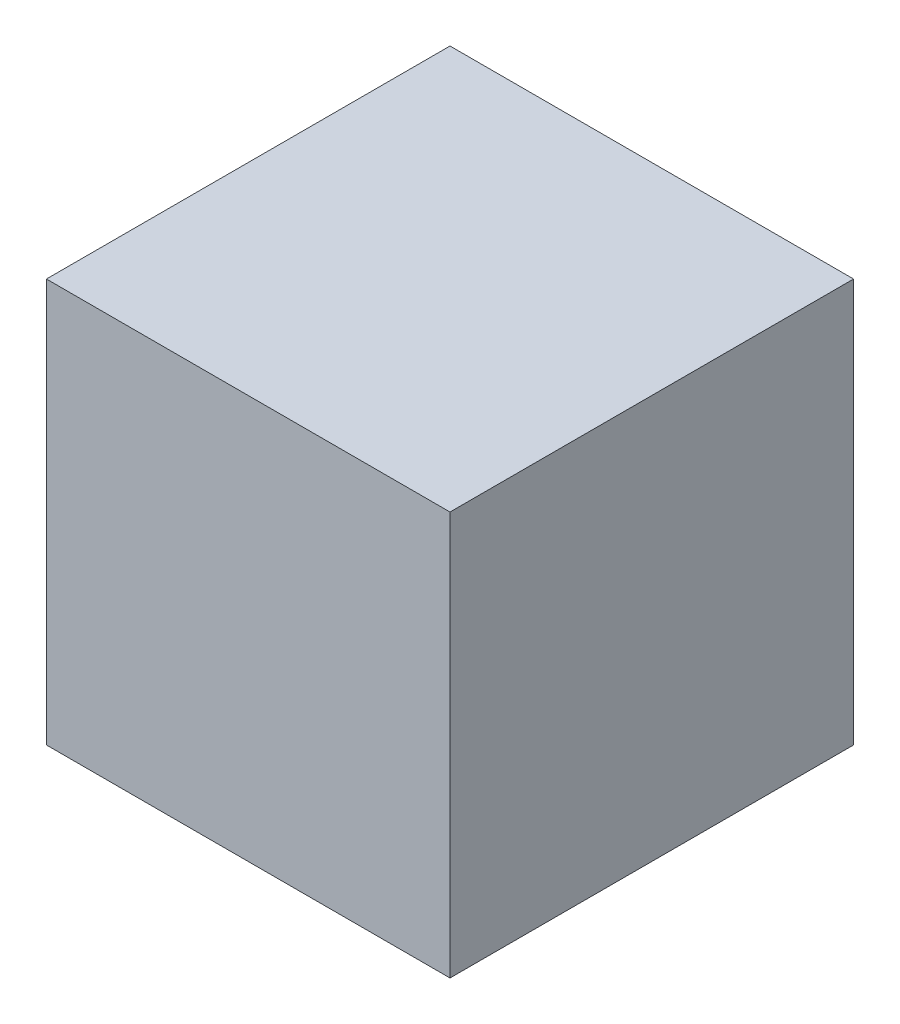
ISO-10303-21;
HEADER;
FILE_DESCRIPTION(('STEP AP214'),'2;1');
FILE_NAME('part.step','',(''),(''),'','','');
FILE_SCHEMA(('AUTOMOTIVE_DESIGN { 1 0 10303 214 1 1 1 1 }'));
ENDSEC;
DATA;
#1=APPLICATION_CONTEXT('core data for automotive mechanical design processes');
#2=APPLICATION_PROTOCOL_DEFINITION('international standard','automotive_design',2000,#1);
#3=PRODUCT_CONTEXT('',#1,'mechanical');
#4=PRODUCT('Part','Part','',(#3));
#5=PRODUCT_RELATED_PRODUCT_CATEGORY('part','',(#4));
#6=PRODUCT_DEFINITION_FORMATION('','',#4);
#7=PRODUCT_DEFINITION_CONTEXT('part definition',#1,'design');
#8=PRODUCT_DEFINITION('design','',#6,#7);
#9=PRODUCT_DEFINITION_SHAPE('','',#8);
#10=(LENGTH_UNIT() NAMED_UNIT(*) SI_UNIT(.MILLI.,.METRE.));
#11=(NAMED_UNIT(*) PLANE_ANGLE_UNIT() SI_UNIT($,.RADIAN.));
#12=(NAMED_UNIT(*) SI_UNIT($,.STERADIAN.) SOLID_ANGLE_UNIT());
#13=UNCERTAINTY_MEASURE_WITH_UNIT(LENGTH_MEASURE(1.E-05),#10,'distance_accuracy_value','');
#14=(GEOMETRIC_REPRESENTATION_CONTEXT(3) GLOBAL_UNCERTAINTY_ASSIGNED_CONTEXT((#13)) GLOBAL_UNIT_ASSIGNED_CONTEXT((#10,
#11,#12)) REPRESENTATION_CONTEXT('',''));
#15=CARTESIAN_POINT('',(0.,0.,0.));
#16=DIRECTION('',(0.,0.,1.));
#17=DIRECTION('',(1.,0.,0.));
#18=AXIS2_PLACEMENT_3D('',#15,#16,#17);
#19=CARTESIAN_POINT('',(0.,0.,58.));
#20=DIRECTION('',(1.,0.,0.));
#21=DIRECTION('',(0.,0.,-1.));
#22=AXIS2_PLACEMENT_3D('',#19,#20,#21);
#23=PLANE('',#22);
#24=DIRECTION('',(0.,-1.,0.));
#25=VECTOR('',#24,1.);
#26=CARTESIAN_POINT('',(0.,0.,0.));
#27=LINE('',#26,#25);
#28=CARTESIAN_POINT('',(0.,58.,0.));
#29=VERTEX_POINT('',#28);
#30=CARTESIAN_POINT('',(0.,0.,0.));
#31=VERTEX_POINT('',#30);
#32=EDGE_CURVE('E95',#29,#31,#27,.T.);
#33=ORIENTED_EDGE('',*,*,#32,.T.);
#34=DIRECTION('',(0.,0.,-1.));
#35=VECTOR('',#34,1.);
#36=CARTESIAN_POINT('',(0.,0.,58.));
#37=LINE('',#36,#35);
#38=CARTESIAN_POINT('',(0.,0.,58.));
#39=VERTEX_POINT('',#38);
#40=EDGE_CURVE('E11',#39,#31,#37,.T.);
#41=ORIENTED_EDGE('',*,*,#40,.F.);
#42=DIRECTION('',(0.,-1.,0.));
#43=VECTOR('',#42,1.);
#44=CARTESIAN_POINT('',(0.,0.,58.));
#45=LINE('',#44,#43);
#46=CARTESIAN_POINT('',(0.,58.,58.));
#47=VERTEX_POINT('',#46);
#48=EDGE_CURVE('E83',#47,#39,#45,.T.);
#49=ORIENTED_EDGE('',*,*,#48,.F.);
#50=DIRECTION('',(0.,0.,-1.));
#51=VECTOR('',#50,1.);
#52=CARTESIAN_POINT('',(0.,58.,58.));
#53=LINE('',#52,#51);
#54=EDGE_CURVE('E91',#47,#29,#53,.T.);
#55=ORIENTED_EDGE('',*,*,#54,.T.);
#56=EDGE_LOOP('',(#33,#41,#49,#55));
#57=FACE_BOUND('',#56,.T.);
#58=ADVANCED_FACE('F32',(#57),#23,.F.);
#59=CARTESIAN_POINT('',(0.,0.,58.));
#60=DIRECTION('',(0.,1.,0.));
#61=DIRECTION('',(0.,0.,1.));
#62=AXIS2_PLACEMENT_3D('',#59,#60,#61);
#63=PLANE('',#62);
#64=DIRECTION('',(1.,0.,0.));
#65=VECTOR('',#64,1.);
#66=CARTESIAN_POINT('',(0.,0.,0.));
#67=LINE('',#66,#65);
#68=CARTESIAN_POINT('',(58.,0.,0.));
#69=VERTEX_POINT('',#68);
#70=EDGE_CURVE('E87',#31,#69,#67,.T.);
#71=ORIENTED_EDGE('',*,*,#70,.T.);
#72=DIRECTION('',(0.,0.,-1.));
#73=VECTOR('',#72,1.);
#74=CARTESIAN_POINT('',(58.,0.,58.));
#75=LINE('',#74,#73);
#76=CARTESIAN_POINT('',(58.,0.,58.));
#77=VERTEX_POINT('',#76);
#78=EDGE_CURVE('E40',#77,#69,#75,.T.);
#79=ORIENTED_EDGE('',*,*,#78,.F.);
#80=DIRECTION('',(1.,0.,0.));
#81=VECTOR('',#80,1.);
#82=CARTESIAN_POINT('',(0.,0.,58.));
#83=LINE('',#82,#81);
#84=EDGE_CURVE('E78',#39,#77,#83,.T.);
#85=ORIENTED_EDGE('',*,*,#84,.F.);
#86=ORIENTED_EDGE('',*,*,#40,.T.);
#87=EDGE_LOOP('',(#71,#79,#85,#86));
#88=FACE_BOUND('',#87,.T.);
#89=ADVANCED_FACE('F86',(#88),#63,.F.);
#90=CARTESIAN_POINT('',(58.,0.,58.));
#91=DIRECTION('',(-1.,0.,0.));
#92=DIRECTION('',(0.,0.,1.));
#93=AXIS2_PLACEMENT_3D('',#90,#91,#92);
#94=PLANE('',#93);
#95=DIRECTION('',(0.,1.,0.));
#96=VECTOR('',#95,1.);
#97=CARTESIAN_POINT('',(58.,0.,0.));
#98=LINE('',#97,#96);
#99=CARTESIAN_POINT('',(58.,58.,0.));
#100=VERTEX_POINT('',#99);
#101=EDGE_CURVE('E65',#69,#100,#98,.T.);
#102=ORIENTED_EDGE('',*,*,#101,.T.);
#103=DIRECTION('',(0.,0.,-1.));
#104=VECTOR('',#103,1.);
#105=CARTESIAN_POINT('',(58.,58.,58.));
#106=LINE('',#105,#104);
#107=CARTESIAN_POINT('',(58.,58.,58.));
#108=VERTEX_POINT('',#107);
#109=EDGE_CURVE('E88',#108,#100,#106,.T.);
#110=ORIENTED_EDGE('',*,*,#109,.F.);
#111=DIRECTION('',(0.,1.,0.));
#112=VECTOR('',#111,1.);
#113=CARTESIAN_POINT('',(58.,0.,58.));
#114=LINE('',#113,#112);
#115=EDGE_CURVE('E81',#77,#108,#114,.T.);
#116=ORIENTED_EDGE('',*,*,#115,.F.);
#117=ORIENTED_EDGE('',*,*,#78,.T.);
#118=EDGE_LOOP('',(#102,#110,#116,#117));
#119=FACE_BOUND('',#118,.T.);
#120=ADVANCED_FACE('F89',(#119),#94,.F.);
#121=CARTESIAN_POINT('',(0.,58.,58.));
#122=DIRECTION('',(0.,-1.,0.));
#123=DIRECTION('',(0.,0.,-1.));
#124=AXIS2_PLACEMENT_3D('',#121,#122,#123);
#125=PLANE('',#124);
#126=DIRECTION('',(-1.,0.,0.));
#127=VECTOR('',#126,1.);
#128=CARTESIAN_POINT('',(0.,58.,0.));
#129=LINE('',#128,#127);
#130=EDGE_CURVE('E71',#100,#29,#129,.T.);
#131=ORIENTED_EDGE('',*,*,#130,.T.);
#132=ORIENTED_EDGE('',*,*,#54,.F.);
#133=DIRECTION('',(-1.,0.,0.));
#134=VECTOR('',#133,1.);
#135=CARTESIAN_POINT('',(0.,58.,58.));
#136=LINE('',#135,#134);
#137=EDGE_CURVE('E48',#108,#47,#136,.T.);
#138=ORIENTED_EDGE('',*,*,#137,.F.);
#139=ORIENTED_EDGE('',*,*,#109,.T.);
#140=EDGE_LOOP('',(#131,#132,#138,#139));
#141=FACE_BOUND('',#140,.T.);
#142=ADVANCED_FACE('F102',(#141),#125,.F.);
#143=CARTESIAN_POINT('',(0.,0.,58.));
#144=DIRECTION('',(0.,0.,-1.));
#145=DIRECTION('',(-1.,0.,0.));
#146=AXIS2_PLACEMENT_3D('',#143,#144,#145);
#147=PLANE('',#146);
#148=ORIENTED_EDGE('',*,*,#48,.T.);
#149=ORIENTED_EDGE('',*,*,#84,.T.);
#150=ORIENTED_EDGE('',*,*,#115,.T.);
#151=ORIENTED_EDGE('',*,*,#137,.T.);
#152=EDGE_LOOP('',(#148,#149,#150,#151));
#153=FACE_BOUND('',#152,.T.);
#154=ADVANCED_FACE('F79',(#153),#147,.F.);
#155=CARTESIAN_POINT('',(0.,0.,0.));
#156=DIRECTION('',(0.,0.,-1.));
#157=DIRECTION('',(-1.,0.,0.));
#158=AXIS2_PLACEMENT_3D('',#155,#156,#157);
#159=PLANE('',#158);
#160=ORIENTED_EDGE('',*,*,#32,.F.);
#161=ORIENTED_EDGE('',*,*,#130,.F.);
#162=ORIENTED_EDGE('',*,*,#101,.F.);
#163=ORIENTED_EDGE('',*,*,#70,.F.);
#164=EDGE_LOOP('',(#160,#161,#162,#163));
#165=FACE_BOUND('',#164,.T.);
#166=ADVANCED_FACE('F105',(#165),#159,.T.);
#167=CLOSED_SHELL('',(#58,#89,#120,#142,#154,#166));
#168=MANIFOLD_SOLID_BREP('B2',#167);
#169=ADVANCED_BREP_SHAPE_REPRESENTATION('',(#18,#168),#14);
#170=SHAPE_DEFINITION_REPRESENTATION(#9,#169);
ENDSEC;
END-ISO-10303-21;
